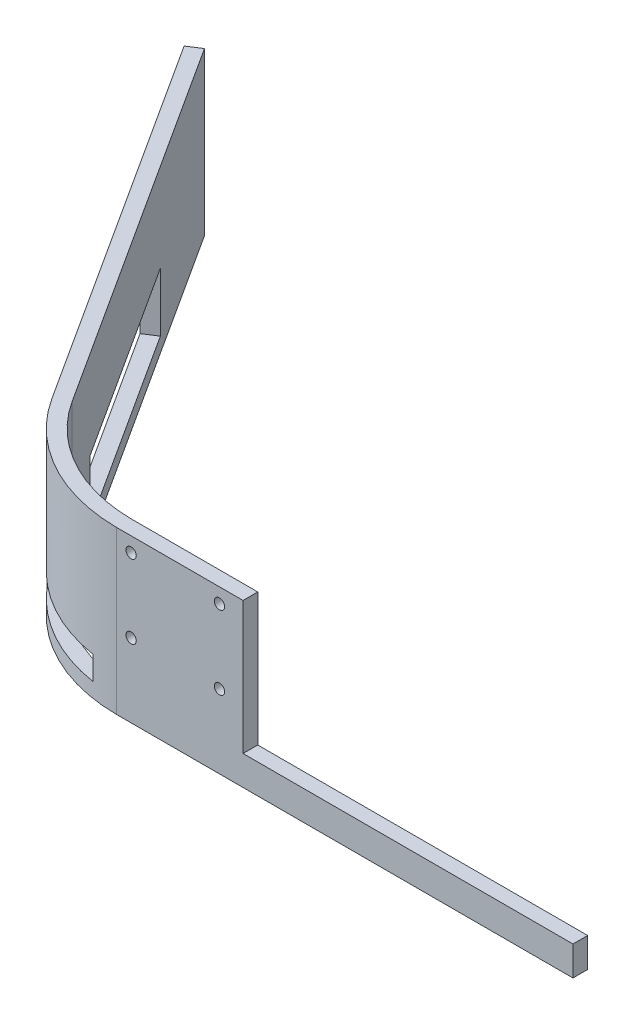
ISO-10303-21;
HEADER;
FILE_DESCRIPTION(('STEP AP214'),'2;1');
FILE_NAME('part.step','',(''),(''),'','','');
FILE_SCHEMA(('AUTOMOTIVE_DESIGN { 1 0 10303 214 1 1 1 1 }'));
ENDSEC;
DATA;
#1=APPLICATION_CONTEXT('core data for automotive mechanical design processes');
#2=APPLICATION_PROTOCOL_DEFINITION('international standard','automotive_design',2000,#1);
#3=PRODUCT_CONTEXT('',#1,'mechanical');
#4=PRODUCT('Part','Part','',(#3));
#5=PRODUCT_RELATED_PRODUCT_CATEGORY('part','',(#4));
#6=PRODUCT_DEFINITION_FORMATION('','',#4);
#7=PRODUCT_DEFINITION_CONTEXT('part definition',#1,'design');
#8=PRODUCT_DEFINITION('design','',#6,#7);
#9=PRODUCT_DEFINITION_SHAPE('','',#8);
#10=(LENGTH_UNIT() NAMED_UNIT(*) SI_UNIT(.MILLI.,.METRE.));
#11=(NAMED_UNIT(*) PLANE_ANGLE_UNIT() SI_UNIT($,.RADIAN.));
#12=(NAMED_UNIT(*) SI_UNIT($,.STERADIAN.) SOLID_ANGLE_UNIT());
#13=UNCERTAINTY_MEASURE_WITH_UNIT(LENGTH_MEASURE(1.E-05),#10,'distance_accuracy_value','');
#14=(GEOMETRIC_REPRESENTATION_CONTEXT(3) GLOBAL_UNCERTAINTY_ASSIGNED_CONTEXT((#13)) GLOBAL_UNIT_ASSIGNED_CONTEXT((#10,
#11,#12)) REPRESENTATION_CONTEXT('',''));
#15=CARTESIAN_POINT('',(0.,0.,0.));
#16=DIRECTION('',(0.,0.,1.));
#17=DIRECTION('',(1.,0.,0.));
#18=AXIS2_PLACEMENT_3D('',#15,#16,#17);
#19=CARTESIAN_POINT('',(0.,55.,0.));
#20=DIRECTION('',(0.,0.,-1.));
#21=DIRECTION('',(-1.,0.,0.));
#22=AXIS2_PLACEMENT_3D('',#19,#20,#21);
#23=PLANE('',#22);
#24=CARTESIAN_POINT('',(35.,25.,0.));
#25=DIRECTION('',(0.,0.,1.));
#26=DIRECTION('',(1.,0.,0.));
#27=AXIS2_PLACEMENT_3D('',#24,#25,#26);
#28=CIRCLE('',#27,1.75);
#29=CARTESIAN_POINT('',(36.75,25.,0.));
#30=VERTEX_POINT('',#29);
#31=EDGE_CURVE('E199',#30,#30,#28,.T.);
#32=ORIENTED_EDGE('',*,*,#31,.F.);
#33=EDGE_LOOP('',(#32));
#34=FACE_BOUND('',#33,.T.);
#35=CARTESIAN_POINT('',(35.,50.,0.));
#36=DIRECTION('',(0.,0.,1.));
#37=DIRECTION('',(1.,0.,0.));
#38=AXIS2_PLACEMENT_3D('',#35,#36,#37);
#39=CIRCLE('',#38,1.75);
#40=CARTESIAN_POINT('',(36.75,50.,0.));
#41=VERTEX_POINT('',#40);
#42=EDGE_CURVE('E224',#41,#41,#39,.T.);
#43=ORIENTED_EDGE('',*,*,#42,.F.);
#44=EDGE_LOOP('',(#43));
#45=FACE_BOUND('',#44,.T.);
#46=CARTESIAN_POINT('',(5.,50.,0.));
#47=DIRECTION('',(0.,0.,1.));
#48=DIRECTION('',(1.,0.,0.));
#49=AXIS2_PLACEMENT_3D('',#46,#47,#48);
#50=CIRCLE('',#49,1.75);
#51=CARTESIAN_POINT('',(6.75,50.,0.));
#52=VERTEX_POINT('',#51);
#53=EDGE_CURVE('E221',#52,#52,#50,.T.);
#54=ORIENTED_EDGE('',*,*,#53,.F.);
#55=EDGE_LOOP('',(#54));
#56=FACE_BOUND('',#55,.T.);
#57=CARTESIAN_POINT('',(5.,25.,0.));
#58=DIRECTION('',(0.,0.,1.));
#59=DIRECTION('',(1.,0.,0.));
#60=AXIS2_PLACEMENT_3D('',#57,#58,#59);
#61=CIRCLE('',#60,1.75);
#62=CARTESIAN_POINT('',(6.75,25.,0.));
#63=VERTEX_POINT('',#62);
#64=EDGE_CURVE('E210',#63,#63,#61,.T.);
#65=ORIENTED_EDGE('',*,*,#64,.F.);
#66=EDGE_LOOP('',(#65));
#67=FACE_BOUND('',#66,.T.);
#68=DIRECTION('',(-1.,0.,0.));
#69=VECTOR('',#68,1.);
#70=CARTESIAN_POINT('',(0.,9.99999999999998,0.));
#71=LINE('',#70,#69);
#72=CARTESIAN_POINT('',(155.,10.,0.));
#73=VERTEX_POINT('',#72);
#74=CARTESIAN_POINT('',(43.,9.99999999999999,0.));
#75=VERTEX_POINT('',#74);
#76=EDGE_CURVE('E209',#73,#75,#71,.T.);
#77=ORIENTED_EDGE('',*,*,#76,.T.);
#78=DIRECTION('',(0.,-1.,0.));
#79=VECTOR('',#78,1.);
#80=CARTESIAN_POINT('',(43.,0.,0.));
#81=LINE('',#80,#79);
#82=CARTESIAN_POINT('',(43.,55.,0.));
#83=VERTEX_POINT('',#82);
#84=EDGE_CURVE('E206',#83,#75,#81,.T.);
#85=ORIENTED_EDGE('',*,*,#84,.F.);
#86=DIRECTION('',(1.,0.,0.));
#87=VECTOR('',#86,1.);
#88=CARTESIAN_POINT('',(0.,55.,0.));
#89=LINE('',#88,#87);
#90=CARTESIAN_POINT('',(0.,55.,0.));
#91=VERTEX_POINT('',#90);
#92=EDGE_CURVE('E240',#91,#83,#89,.T.);
#93=ORIENTED_EDGE('',*,*,#92,.F.);
#94=DIRECTION('',(0.,-1.,0.));
#95=VECTOR('',#94,1.);
#96=CARTESIAN_POINT('',(0.,55.,0.));
#97=LINE('',#96,#95);
#98=CARTESIAN_POINT('',(0.,0.,0.));
#99=VERTEX_POINT('',#98);
#100=EDGE_CURVE('E303',#91,#99,#97,.T.);
#101=ORIENTED_EDGE('',*,*,#100,.T.);
#102=DIRECTION('',(1.,0.,0.));
#103=VECTOR('',#102,1.);
#104=CARTESIAN_POINT('',(0.,0.,0.));
#105=LINE('',#104,#103);
#106=CARTESIAN_POINT('',(155.,0.,0.));
#107=VERTEX_POINT('',#106);
#108=EDGE_CURVE('E270',#99,#107,#105,.T.);
#109=ORIENTED_EDGE('',*,*,#108,.T.);
#110=DIRECTION('',(0.,-1.,0.));
#111=VECTOR('',#110,1.);
#112=CARTESIAN_POINT('',(155.,55.,0.));
#113=LINE('',#112,#111);
#114=EDGE_CURVE('E301',#73,#107,#113,.T.);
#115=ORIENTED_EDGE('',*,*,#114,.F.);
#116=EDGE_LOOP('',(#77,#85,#93,#101,#109,#115));
#117=FACE_BOUND('',#116,.T.);
#118=ADVANCED_FACE('F39',(#34,#45,#56,#67,#117),#23,.F.);
#119=CARTESIAN_POINT('',(155.,55.,0.));
#120=DIRECTION('',(-1.,0.,0.));
#121=DIRECTION('',(0.,0.,1.));
#122=AXIS2_PLACEMENT_3D('',#119,#120,#121);
#123=PLANE('',#122);
#124=DIRECTION('',(0.,0.,1.));
#125=VECTOR('',#124,1.);
#126=CARTESIAN_POINT('',(155.,10.,-55.));
#127=LINE('',#126,#125);
#128=CARTESIAN_POINT('',(155.,10.,-5.));
#129=VERTEX_POINT('',#128);
#130=EDGE_CURVE('E214',#129,#73,#127,.T.);
#131=ORIENTED_EDGE('',*,*,#130,.T.);
#132=ORIENTED_EDGE('',*,*,#114,.T.);
#133=DIRECTION('',(0.,0.,-1.));
#134=VECTOR('',#133,1.);
#135=CARTESIAN_POINT('',(155.,0.,0.));
#136=LINE('',#135,#134);
#137=CARTESIAN_POINT('',(155.,0.,-5.));
#138=VERTEX_POINT('',#137);
#139=EDGE_CURVE('E275',#107,#138,#136,.T.);
#140=ORIENTED_EDGE('',*,*,#139,.T.);
#141=DIRECTION('',(0.,-1.,0.));
#142=VECTOR('',#141,1.);
#143=CARTESIAN_POINT('',(155.,55.,-5.));
#144=LINE('',#143,#142);
#145=EDGE_CURVE('E299',#129,#138,#144,.T.);
#146=ORIENTED_EDGE('',*,*,#145,.F.);
#147=EDGE_LOOP('',(#131,#132,#140,#146));
#148=FACE_BOUND('',#147,.T.);
#149=ADVANCED_FACE('F359',(#148),#123,.F.);
#150=CARTESIAN_POINT('',(0.,55.,-5.));
#151=DIRECTION('',(0.,0.,-1.));
#152=DIRECTION('',(-1.,0.,0.));
#153=AXIS2_PLACEMENT_3D('',#150,#151,#152);
#154=PLANE('',#153);
#155=CARTESIAN_POINT('',(5.,25.,-5.));
#156=DIRECTION('',(0.,0.,-1.));
#157=DIRECTION('',(-1.,0.,0.));
#158=AXIS2_PLACEMENT_3D('',#155,#156,#157);
#159=CIRCLE('',#158,1.75);
#160=CARTESIAN_POINT('',(3.25,25.,-5.));
#161=VERTEX_POINT('',#160);
#162=EDGE_CURVE('E265',#161,#161,#159,.T.);
#163=ORIENTED_EDGE('',*,*,#162,.F.);
#164=EDGE_LOOP('',(#163));
#165=FACE_BOUND('',#164,.T.);
#166=CARTESIAN_POINT('',(5.,50.,-5.));
#167=DIRECTION('',(0.,0.,-1.));
#168=DIRECTION('',(-1.,0.,0.));
#169=AXIS2_PLACEMENT_3D('',#166,#167,#168);
#170=CIRCLE('',#169,1.75);
#171=CARTESIAN_POINT('',(3.25,50.,-5.));
#172=VERTEX_POINT('',#171);
#173=EDGE_CURVE('E662',#172,#172,#170,.T.);
#174=ORIENTED_EDGE('',*,*,#173,.F.);
#175=EDGE_LOOP('',(#174));
#176=FACE_BOUND('',#175,.T.);
#177=CARTESIAN_POINT('',(35.,50.,-5.));
#178=DIRECTION('',(0.,0.,-1.));
#179=DIRECTION('',(-1.,0.,0.));
#180=AXIS2_PLACEMENT_3D('',#177,#178,#179);
#181=CIRCLE('',#180,1.75);
#182=CARTESIAN_POINT('',(33.25,50.,-5.));
#183=VERTEX_POINT('',#182);
#184=EDGE_CURVE('E659',#183,#183,#181,.T.);
#185=ORIENTED_EDGE('',*,*,#184,.F.);
#186=EDGE_LOOP('',(#185));
#187=FACE_BOUND('',#186,.T.);
#188=CARTESIAN_POINT('',(35.,25.,-5.));
#189=DIRECTION('',(0.,0.,-1.));
#190=DIRECTION('',(-1.,0.,0.));
#191=AXIS2_PLACEMENT_3D('',#188,#189,#190);
#192=CIRCLE('',#191,1.75);
#193=CARTESIAN_POINT('',(33.25,25.,-5.));
#194=VERTEX_POINT('',#193);
#195=EDGE_CURVE('E230',#194,#194,#192,.T.);
#196=ORIENTED_EDGE('',*,*,#195,.F.);
#197=EDGE_LOOP('',(#196));
#198=FACE_BOUND('',#197,.T.);
#199=DIRECTION('',(0.,1.,0.));
#200=VECTOR('',#199,1.);
#201=CARTESIAN_POINT('',(43.,55.,-5.));
#202=LINE('',#201,#200);
#203=CARTESIAN_POINT('',(43.,9.99999999999999,-5.));
#204=VERTEX_POINT('',#203);
#205=CARTESIAN_POINT('',(43.,55.,-5.));
#206=VERTEX_POINT('',#205);
#207=EDGE_CURVE('E217',#204,#206,#202,.T.);
#208=ORIENTED_EDGE('',*,*,#207,.F.);
#209=DIRECTION('',(1.,0.,0.));
#210=VECTOR('',#209,1.);
#211=CARTESIAN_POINT('',(0.,9.99999999999998,-5.));
#212=LINE('',#211,#210);
#213=EDGE_CURVE('E383',#204,#129,#212,.T.);
#214=ORIENTED_EDGE('',*,*,#213,.T.);
#215=ORIENTED_EDGE('',*,*,#145,.T.);
#216=DIRECTION('',(1.,0.,0.));
#217=VECTOR('',#216,1.);
#218=CARTESIAN_POINT('',(0.,0.,-5.));
#219=LINE('',#218,#217);
#220=CARTESIAN_POINT('',(0.,0.,-5.));
#221=VERTEX_POINT('',#220);
#222=EDGE_CURVE('E278',#221,#138,#219,.T.);
#223=ORIENTED_EDGE('',*,*,#222,.F.);
#224=DIRECTION('',(0.,-1.,0.));
#225=VECTOR('',#224,1.);
#226=CARTESIAN_POINT('',(0.,55.,-5.));
#227=LINE('',#226,#225);
#228=CARTESIAN_POINT('',(0.,55.,-5.));
#229=VERTEX_POINT('',#228);
#230=EDGE_CURVE('E297',#229,#221,#227,.T.);
#231=ORIENTED_EDGE('',*,*,#230,.F.);
#232=DIRECTION('',(1.,0.,0.));
#233=VECTOR('',#232,1.);
#234=CARTESIAN_POINT('',(0.,55.,-5.));
#235=LINE('',#234,#233);
#236=EDGE_CURVE('E245',#229,#206,#235,.T.);
#237=ORIENTED_EDGE('',*,*,#236,.T.);
#238=EDGE_LOOP('',(#208,#214,#215,#223,#231,#237));
#239=FACE_BOUND('',#238,.T.);
#240=ADVANCED_FACE('F333',(#165,#176,#187,#198,#239),#154,.T.);
#241=CARTESIAN_POINT('',(-22.2397076710408,55.,14.3229453383998));
#242=DIRECTION('',(-0.840731265834287,0.,0.541452619024673));
#243=DIRECTION('',(0.541452619024673,0.,0.840731265834287));
#244=AXIS2_PLACEMENT_3D('',#241,#242,#243);
#245=PLANE('',#244);
#246=DIRECTION('',(0.,1.,0.));
#247=VECTOR('',#246,1.);
#248=CARTESIAN_POINT('',(-59.6111595267926,25.,-43.7049354415426));
#249=LINE('',#248,#247);
#250=CARTESIAN_POINT('',(-59.6111595267926,5.,-43.7049354415426));
#251=VERTEX_POINT('',#250);
#252=CARTESIAN_POINT('',(-59.6111595267926,25.,-43.7049354415426));
#253=VERTEX_POINT('',#252);
#254=EDGE_CURVE('E181',#251,#253,#249,.T.);
#255=ORIENTED_EDGE('',*,*,#254,.F.);
#256=DIRECTION('',(0.541452619024673,0.,0.840731265834287));
#257=VECTOR('',#256,1.);
#258=CARTESIAN_POINT('',(-59.6111595267926,5.,-43.7049354415426));
#259=LINE('',#258,#257);
#260=CARTESIAN_POINT('',(-102.927369048766,4.99999999999999,-110.963436708286));
#261=VERTEX_POINT('',#260);
#262=EDGE_CURVE('E193',#261,#251,#259,.T.);
#263=ORIENTED_EDGE('',*,*,#262,.F.);
#264=DIRECTION('',(0.,-1.,0.));
#265=VECTOR('',#264,1.);
#266=CARTESIAN_POINT('',(-102.927369048766,25.,-110.963436708286));
#267=LINE('',#266,#265);
#268=CARTESIAN_POINT('',(-102.927369048766,25.,-110.963436708286));
#269=VERTEX_POINT('',#268);
#270=EDGE_CURVE('E190',#269,#261,#267,.T.);
#271=ORIENTED_EDGE('',*,*,#270,.F.);
#272=DIRECTION('',(-0.541452619024673,0.,-0.840731265834287));
#273=VECTOR('',#272,1.);
#274=CARTESIAN_POINT('',(-59.6111595267926,25.,-43.7049354415426));
#275=LINE('',#274,#273);
#276=EDGE_CURVE('E183',#253,#269,#275,.T.);
#277=ORIENTED_EDGE('',*,*,#276,.F.);
#278=EDGE_LOOP('',(#255,#263,#271,#277));
#279=FACE_BOUND('',#278,.T.);
#280=DIRECTION('',(-0.541452619024673,0.,-0.840731265834287));
#281=VECTOR('',#280,1.);
#282=CARTESIAN_POINT('',(-22.2397076710408,0.,14.3229453383998));
#283=LINE('',#282,#281);
#284=CARTESIAN_POINT('',(-48.7821071462992,0.,-26.8903101248569));
#285=VERTEX_POINT('',#284);
#286=CARTESIAN_POINT('',(-130.,0.,-153.));
#287=VERTEX_POINT('',#286);
#288=EDGE_CURVE('E261',#285,#287,#283,.T.);
#289=ORIENTED_EDGE('',*,*,#288,.F.);
#290=CARTESIAN_POINT('',(-48.7821071462991,55.,-26.8903101248569));
#291=DIRECTION('',(0.,-1.,0.));
#292=VECTOR('',#291,1.);
#293=LINE('',#290,#292);
#294=CARTESIAN_POINT('',(-48.7821071462992,55.,-26.8903101248569));
#295=VERTEX_POINT('',#294);
#296=EDGE_CURVE('E305',#295,#285,#293,.T.);
#297=ORIENTED_EDGE('',*,*,#296,.F.);
#298=DIRECTION('',(-0.541452619024673,0.,-0.840731265834287));
#299=VECTOR('',#298,1.);
#300=CARTESIAN_POINT('',(-22.2397076710408,55.,14.3229453383998));
#301=LINE('',#300,#299);
#302=CARTESIAN_POINT('',(-130.,55.,-153.));
#303=VERTEX_POINT('',#302);
#304=EDGE_CURVE('E231',#295,#303,#301,.T.);
#305=ORIENTED_EDGE('',*,*,#304,.T.);
#306=DIRECTION('',(0.,-1.,0.));
#307=VECTOR('',#306,1.);
#308=CARTESIAN_POINT('',(-130.,55.,-153.));
#309=LINE('',#308,#307);
#310=EDGE_CURVE('E260',#303,#287,#309,.T.);
#311=ORIENTED_EDGE('',*,*,#310,.T.);
#312=EDGE_LOOP('',(#289,#297,#305,#311));
#313=FACE_BOUND('',#312,.T.);
#314=ADVANCED_FACE('F41',(#279,#313),#245,.T.);
#315=CARTESIAN_POINT('',(0.396550759782094,55.,-58.4127127013932));
#316=DIRECTION('',(0.,-1.,0.));
#317=DIRECTION('',(0.,0.,-1.));
#318=AXIS2_PLACEMENT_3D('',#315,#316,#317);
#319=CYLINDRICAL_SURFACE('',#318,58.4140587328136);
#320=DIRECTION('',(0.,-1.,0.));
#321=VECTOR('',#320,1.);
#322=CARTESIAN_POINT('',(-8.73504579594361,55.,-0.716818549520951));
#323=LINE('',#322,#321);
#324=CARTESIAN_POINT('',(-8.73504579594363,5.,-0.716818549520958));
#325=VERTEX_POINT('',#324);
#326=CARTESIAN_POINT('',(-8.73504579594363,13.,-0.716818549520958));
#327=VERTEX_POINT('',#326);
#328=EDGE_CURVE('E173',#325,#327,#323,.F.);
#329=ORIENTED_EDGE('',*,*,#328,.F.);
#330=CARTESIAN_POINT('',(0.396550759782094,5.,-58.4127127013932));
#331=DIRECTION('',(0.,-1.,0.));
#332=DIRECTION('',(0.,0.,-1.));
#333=AXIS2_PLACEMENT_3D('',#330,#331,#332);
#334=CIRCLE('',#333,58.4140587328136);
#335=CARTESIAN_POINT('',(-43.714548340817,5.,-20.1189378316091));
#336=VERTEX_POINT('',#335);
#337=EDGE_CURVE('E162',#336,#325,#334,.F.);
#338=ORIENTED_EDGE('',*,*,#337,.F.);
#339=DIRECTION('',(0.,-1.,0.));
#340=VECTOR('',#339,1.);
#341=CARTESIAN_POINT('',(-43.714548340817,55.,-20.1189378316091));
#342=LINE('',#341,#340);
#343=CARTESIAN_POINT('',(-43.714548340817,13.,-20.1189378316091));
#344=VERTEX_POINT('',#343);
#345=EDGE_CURVE('E167',#344,#336,#342,.T.);
#346=ORIENTED_EDGE('',*,*,#345,.F.);
#347=CARTESIAN_POINT('',(0.396550759782094,13.,-58.4127127013932));
#348=DIRECTION('',(0.,1.,0.));
#349=DIRECTION('',(0.,0.,1.));
#350=AXIS2_PLACEMENT_3D('',#347,#348,#349);
#351=CIRCLE('',#350,58.4140587328136);
#352=EDGE_CURVE('E180',#327,#344,#351,.F.);
#353=ORIENTED_EDGE('',*,*,#352,.F.);
#354=EDGE_LOOP('',(#329,#338,#346,#353));
#355=FACE_BOUND('',#354,.T.);
#356=CARTESIAN_POINT('',(0.396550759782094,0.,-58.4127127013932));
#357=DIRECTION('',(0.,1.,0.));
#358=DIRECTION('',(0.,0.,1.));
#359=AXIS2_PLACEMENT_3D('',#356,#357,#358);
#360=CIRCLE('',#359,58.4140587328136);
#361=EDGE_CURVE('E264',#99,#285,#360,.F.);
#362=ORIENTED_EDGE('',*,*,#361,.F.);
#363=ORIENTED_EDGE('',*,*,#100,.F.);
#364=CARTESIAN_POINT('',(0.396550759782094,55.,-58.4127127013932));
#365=DIRECTION('',(0.,1.,0.));
#366=DIRECTION('',(0.,0.,1.));
#367=AXIS2_PLACEMENT_3D('',#364,#365,#366);
#368=CIRCLE('',#367,58.4140587328136);
#369=EDGE_CURVE('E234',#91,#295,#368,.F.);
#370=ORIENTED_EDGE('',*,*,#369,.T.);
#371=ORIENTED_EDGE('',*,*,#296,.T.);
#372=EDGE_LOOP('',(#362,#363,#370,#371));
#373=FACE_BOUND('',#372,.T.);
#374=ADVANCED_FACE('F178',(#355,#373),#319,.T.);
#375=CARTESIAN_POINT('',(0.396550759782094,55.,-58.4127127013932));
#376=DIRECTION('',(0.,-1.,0.));
#377=DIRECTION('',(0.,0.,-1.));
#378=AXIS2_PLACEMENT_3D('',#375,#376,#377);
#379=CYLINDRICAL_SURFACE('',#378,53.4141847323972);
#380=CARTESIAN_POINT('',(0.396550759782094,5.,-58.4127127013932));
#381=DIRECTION('',(0.,-1.,0.));
#382=DIRECTION('',(0.,0.,-1.));
#383=AXIS2_PLACEMENT_3D('',#380,#381,#382);
#384=CIRCLE('',#383,53.4141847323972);
#385=CARTESIAN_POINT('',(-41.1251384924856,5.,-24.8117536039988));
#386=VERTEX_POINT('',#385);
#387=CARTESIAN_POINT('',(-6.15025832676357,5.,-5.40125713364843));
#388=VERTEX_POINT('',#387);
#389=EDGE_CURVE('E400',#386,#388,#384,.F.);
#390=ORIENTED_EDGE('',*,*,#389,.T.);
#391=DIRECTION('',(0.,-1.,0.));
#392=VECTOR('',#391,1.);
#393=CARTESIAN_POINT('',(-6.15025832676355,55.,-5.40125713364842));
#394=LINE('',#393,#392);
#395=CARTESIAN_POINT('',(-6.15025832676357,13.,-5.40125713364843));
#396=VERTEX_POINT('',#395);
#397=EDGE_CURVE('E11',#388,#396,#394,.F.);
#398=ORIENTED_EDGE('',*,*,#397,.T.);
#399=CARTESIAN_POINT('',(0.396550759782094,13.,-58.4127127013932));
#400=DIRECTION('',(0.,1.,0.));
#401=DIRECTION('',(0.,0.,1.));
#402=AXIS2_PLACEMENT_3D('',#399,#400,#401);
#403=CIRCLE('',#402,53.4141847323972);
#404=CARTESIAN_POINT('',(-41.1251384924856,13.,-24.8117536039988));
#405=VERTEX_POINT('',#404);
#406=EDGE_CURVE('E48',#396,#405,#403,.F.);
#407=ORIENTED_EDGE('',*,*,#406,.T.);
#408=DIRECTION('',(0.,-1.,0.));
#409=VECTOR('',#408,1.);
#410=CARTESIAN_POINT('',(-41.1251384924856,55.,-24.8117536039988));
#411=LINE('',#410,#409);
#412=EDGE_CURVE('E402',#405,#386,#411,.T.);
#413=ORIENTED_EDGE('',*,*,#412,.T.);
#414=EDGE_LOOP('',(#390,#398,#407,#413));
#415=FACE_BOUND('',#414,.T.);
#416=CARTESIAN_POINT('',(0.396550759782094,0.,-58.4127127013932));
#417=DIRECTION('',(0.,1.,0.));
#418=DIRECTION('',(0.,0.,1.));
#419=AXIS2_PLACEMENT_3D('',#416,#417,#418);
#420=CIRCLE('',#419,53.4141847323972);
#421=CARTESIAN_POINT('',(-44.5784984681423,0.,-29.5975426109476));
#422=VERTEX_POINT('',#421);
#423=EDGE_CURVE('E281',#221,#422,#420,.F.);
#424=ORIENTED_EDGE('',*,*,#423,.T.);
#425=CARTESIAN_POINT('',(-44.5784508532954,55.,-29.5975732761371));
#426=DIRECTION('',(0.,-1.,0.));
#427=VECTOR('',#426,1.);
#428=LINE('',#425,#427);
#429=CARTESIAN_POINT('',(-44.5784984681423,55.,-29.5975426109476));
#430=VERTEX_POINT('',#429);
#431=EDGE_CURVE('E296',#430,#422,#428,.T.);
#432=ORIENTED_EDGE('',*,*,#431,.F.);
#433=CARTESIAN_POINT('',(0.396550759782094,55.,-58.4127127013932));
#434=DIRECTION('',(0.,1.,0.));
#435=DIRECTION('',(0.,0.,1.));
#436=AXIS2_PLACEMENT_3D('',#433,#434,#435);
#437=CIRCLE('',#436,53.4141847323972);
#438=EDGE_CURVE('E248',#229,#430,#437,.F.);
#439=ORIENTED_EDGE('',*,*,#438,.F.);
#440=ORIENTED_EDGE('',*,*,#230,.T.);
#441=EDGE_LOOP('',(#424,#432,#439,#440));
#442=FACE_BOUND('',#441,.T.);
#443=ADVANCED_FACE('F326',(#415,#442),#379,.F.);
#444=CARTESIAN_POINT('',(-18.0360513418706,55.,11.6156822432771));
#445=DIRECTION('',(0.840731265834291,0.,-0.541452619024667));
#446=DIRECTION('',(-0.541452619024667,0.,-0.840731265834291));
#447=AXIS2_PLACEMENT_3D('',#444,#445,#446);
#448=PLANE('',#447);
#449=DIRECTION('',(0.,-1.,0.));
#450=VECTOR('',#449,1.);
#451=CARTESIAN_POINT('',(-55.4075031976219,55.,-46.4121985366655));
#452=LINE('',#451,#450);
#453=CARTESIAN_POINT('',(-55.4075031976219,25.,-46.4121985366655));
#454=VERTEX_POINT('',#453);
#455=CARTESIAN_POINT('',(-55.4075031976219,5.,-46.4121985366655));
#456=VERTEX_POINT('',#455);
#457=EDGE_CURVE('E398',#454,#456,#452,.T.);
#458=ORIENTED_EDGE('',*,*,#457,.F.);
#459=DIRECTION('',(0.541452619024667,0.,0.840731265834291));
#460=VECTOR('',#459,1.);
#461=CARTESIAN_POINT('',(-18.0360513418706,25.,11.6156822432771));
#462=LINE('',#461,#460);
#463=CARTESIAN_POINT('',(-98.7237127195953,25.,-113.670699803409));
#464=VERTEX_POINT('',#463);
#465=EDGE_CURVE('E385',#464,#454,#462,.T.);
#466=ORIENTED_EDGE('',*,*,#465,.F.);
#467=DIRECTION('',(0.,1.,0.));
#468=VECTOR('',#467,1.);
#469=CARTESIAN_POINT('',(-98.7237127195953,55.,-113.670699803409));
#470=LINE('',#469,#468);
#471=CARTESIAN_POINT('',(-98.7237127195952,4.99999999999999,-113.670699803409));
#472=VERTEX_POINT('',#471);
#473=EDGE_CURVE('E388',#472,#464,#470,.T.);
#474=ORIENTED_EDGE('',*,*,#473,.F.);
#475=DIRECTION('',(-0.541452619024667,0.,-0.840731265834291));
#476=VECTOR('',#475,1.);
#477=CARTESIAN_POINT('',(-18.0360513418706,5.00000000000001,11.6156822432771));
#478=LINE('',#477,#476);
#479=EDGE_CURVE('E396',#456,#472,#478,.T.);
#480=ORIENTED_EDGE('',*,*,#479,.F.);
#481=EDGE_LOOP('',(#458,#466,#474,#480));
#482=FACE_BOUND('',#481,.T.);
#483=DIRECTION('',(0.541452619024667,0.,0.840731265834291));
#484=VECTOR('',#483,1.);
#485=CARTESIAN_POINT('',(-18.0360513418706,0.,11.6156822432771));
#486=LINE('',#485,#484);
#487=CARTESIAN_POINT('',(-125.796343670829,0.,-155.707263095123));
#488=VERTEX_POINT('',#487);
#489=EDGE_CURVE('E284',#488,#422,#486,.T.);
#490=ORIENTED_EDGE('',*,*,#489,.F.);
#491=DIRECTION('',(0.,-1.,0.));
#492=VECTOR('',#491,1.);
#493=CARTESIAN_POINT('',(-125.796343670829,55.,-155.707263095123));
#494=LINE('',#493,#492);
#495=CARTESIAN_POINT('',(-125.796343670829,55.,-155.707263095123));
#496=VERTEX_POINT('',#495);
#497=EDGE_CURVE('E294',#496,#488,#494,.T.);
#498=ORIENTED_EDGE('',*,*,#497,.F.);
#499=DIRECTION('',(0.541452619024667,0.,0.840731265834291));
#500=VECTOR('',#499,1.);
#501=CARTESIAN_POINT('',(-18.0360513418706,55.,11.6156822432771));
#502=LINE('',#501,#500);
#503=EDGE_CURVE('E250',#496,#430,#502,.T.);
#504=ORIENTED_EDGE('',*,*,#503,.T.);
#505=ORIENTED_EDGE('',*,*,#431,.T.);
#506=EDGE_LOOP('',(#490,#498,#504,#505));
#507=FACE_BOUND('',#506,.T.);
#508=ADVANCED_FACE('F315',(#482,#507),#448,.T.);
#509=CARTESIAN_POINT('',(-107.760292328958,55.,-167.3229453384));
#510=DIRECTION('',(-0.541452619024669,0.,-0.840731265834289));
#511=DIRECTION('',(-0.840731265834289,0.,0.541452619024669));
#512=AXIS2_PLACEMENT_3D('',#509,#510,#511);
#513=PLANE('',#512);
#514=DIRECTION('',(0.840731265834289,0.,-0.541452619024669));
#515=VECTOR('',#514,1.);
#516=CARTESIAN_POINT('',(-107.760292328958,0.,-167.3229453384));
#517=LINE('',#516,#515);
#518=EDGE_CURVE('E235',#287,#488,#517,.T.);
#519=ORIENTED_EDGE('',*,*,#518,.F.);
#520=ORIENTED_EDGE('',*,*,#310,.F.);
#521=DIRECTION('',(0.840731265834289,0.,-0.541452619024669));
#522=VECTOR('',#521,1.);
#523=CARTESIAN_POINT('',(-107.760292328958,55.,-167.3229453384));
#524=LINE('',#523,#522);
#525=EDGE_CURVE('E255',#303,#496,#524,.T.);
#526=ORIENTED_EDGE('',*,*,#525,.T.);
#527=ORIENTED_EDGE('',*,*,#497,.T.);
#528=EDGE_LOOP('',(#519,#520,#526,#527));
#529=FACE_BOUND('',#528,.T.);
#530=ADVANCED_FACE('F325',(#529),#513,.T.);
#531=CARTESIAN_POINT('',(0.,55.,0.));
#532=DIRECTION('',(0.,1.,0.));
#533=DIRECTION('',(0.,0.,1.));
#534=AXIS2_PLACEMENT_3D('',#531,#532,#533);
#535=PLANE('',#534);
#536=DIRECTION('',(0.,0.,1.));
#537=VECTOR('',#536,1.);
#538=CARTESIAN_POINT('',(43.,55.,0.));
#539=LINE('',#538,#537);
#540=EDGE_CURVE('E386',#206,#83,#539,.T.);
#541=ORIENTED_EDGE('',*,*,#540,.F.);
#542=ORIENTED_EDGE('',*,*,#236,.F.);
#543=ORIENTED_EDGE('',*,*,#438,.T.);
#544=ORIENTED_EDGE('',*,*,#503,.F.);
#545=ORIENTED_EDGE('',*,*,#525,.F.);
#546=ORIENTED_EDGE('',*,*,#304,.F.);
#547=ORIENTED_EDGE('',*,*,#369,.F.);
#548=ORIENTED_EDGE('',*,*,#92,.T.);
#549=EDGE_LOOP('',(#541,#542,#543,#544,#545,#546,#547,#548));
#550=FACE_BOUND('',#549,.T.);
#551=ADVANCED_FACE('F466',(#550),#535,.T.);
#552=CARTESIAN_POINT('',(0.,0.,0.));
#553=DIRECTION('',(0.,1.,0.));
#554=DIRECTION('',(0.,0.,1.));
#555=AXIS2_PLACEMENT_3D('',#552,#553,#554);
#556=PLANE('',#555);
#557=ORIENTED_EDGE('',*,*,#288,.T.);
#558=ORIENTED_EDGE('',*,*,#518,.T.);
#559=ORIENTED_EDGE('',*,*,#489,.T.);
#560=ORIENTED_EDGE('',*,*,#423,.F.);
#561=ORIENTED_EDGE('',*,*,#222,.T.);
#562=ORIENTED_EDGE('',*,*,#139,.F.);
#563=ORIENTED_EDGE('',*,*,#108,.F.);
#564=ORIENTED_EDGE('',*,*,#361,.T.);
#565=EDGE_LOOP('',(#557,#558,#559,#560,#561,#562,#563,#564));
#566=FACE_BOUND('',#565,.T.);
#567=ADVANCED_FACE('F377',(#566),#556,.F.);
#568=CARTESIAN_POINT('',(0.,9.99999999999998,-55.));
#569=DIRECTION('',(0.,1.,0.));
#570=DIRECTION('',(-1.,0.,0.));
#571=AXIS2_PLACEMENT_3D('',#568,#569,#570);
#572=PLANE('',#571);
#573=DIRECTION('',(0.,0.,1.));
#574=VECTOR('',#573,1.);
#575=CARTESIAN_POINT('',(43.,9.99999999999999,-55.));
#576=LINE('',#575,#574);
#577=EDGE_CURVE('E213',#204,#75,#576,.T.);
#578=ORIENTED_EDGE('',*,*,#577,.T.);
#579=ORIENTED_EDGE('',*,*,#76,.F.);
#580=ORIENTED_EDGE('',*,*,#130,.F.);
#581=ORIENTED_EDGE('',*,*,#213,.F.);
#582=EDGE_LOOP('',(#578,#579,#580,#581));
#583=FACE_BOUND('',#582,.T.);
#584=ADVANCED_FACE('F444',(#583),#572,.T.);
#585=CARTESIAN_POINT('',(43.,0.,-55.));
#586=DIRECTION('',(-1.,0.,0.));
#587=DIRECTION('',(0.,0.,1.));
#588=AXIS2_PLACEMENT_3D('',#585,#586,#587);
#589=PLANE('',#588);
#590=ORIENTED_EDGE('',*,*,#207,.T.);
#591=ORIENTED_EDGE('',*,*,#540,.T.);
#592=ORIENTED_EDGE('',*,*,#84,.T.);
#593=ORIENTED_EDGE('',*,*,#577,.F.);
#594=EDGE_LOOP('',(#590,#591,#592,#593));
#595=FACE_BOUND('',#594,.T.);
#596=ADVANCED_FACE('F447',(#595),#589,.F.);
#597=CARTESIAN_POINT('',(35.,25.,-55.));
#598=DIRECTION('',(0.,0.,1.));
#599=DIRECTION('',(1.,0.,0.));
#600=AXIS2_PLACEMENT_3D('',#597,#598,#599);
#601=CYLINDRICAL_SURFACE('',#600,1.75);
#602=ORIENTED_EDGE('',*,*,#195,.T.);
#603=EDGE_LOOP('',(#602));
#604=FACE_BOUND('',#603,.T.);
#605=ORIENTED_EDGE('',*,*,#31,.T.);
#606=EDGE_LOOP('',(#605));
#607=FACE_BOUND('',#606,.T.);
#608=ADVANCED_FACE('F450',(#604,#607),#601,.F.);
#609=CARTESIAN_POINT('',(35.,50.,-55.));
#610=DIRECTION('',(0.,0.,1.));
#611=DIRECTION('',(1.,0.,0.));
#612=AXIS2_PLACEMENT_3D('',#609,#610,#611);
#613=CYLINDRICAL_SURFACE('',#612,1.75);
#614=ORIENTED_EDGE('',*,*,#184,.T.);
#615=EDGE_LOOP('',(#614));
#616=FACE_BOUND('',#615,.T.);
#617=ORIENTED_EDGE('',*,*,#42,.T.);
#618=EDGE_LOOP('',(#617));
#619=FACE_BOUND('',#618,.T.);
#620=ADVANCED_FACE('F458',(#616,#619),#613,.F.);
#621=CARTESIAN_POINT('',(5.,50.,-55.));
#622=DIRECTION('',(0.,0.,1.));
#623=DIRECTION('',(1.,0.,0.));
#624=AXIS2_PLACEMENT_3D('',#621,#622,#623);
#625=CYLINDRICAL_SURFACE('',#624,1.75);
#626=ORIENTED_EDGE('',*,*,#173,.T.);
#627=EDGE_LOOP('',(#626));
#628=FACE_BOUND('',#627,.T.);
#629=ORIENTED_EDGE('',*,*,#53,.T.);
#630=EDGE_LOOP('',(#629));
#631=FACE_BOUND('',#630,.T.);
#632=ADVANCED_FACE('F454',(#628,#631),#625,.F.);
#633=CARTESIAN_POINT('',(5.,25.,-55.));
#634=DIRECTION('',(0.,0.,1.));
#635=DIRECTION('',(1.,0.,0.));
#636=AXIS2_PLACEMENT_3D('',#633,#634,#635);
#637=CYLINDRICAL_SURFACE('',#636,1.75);
#638=ORIENTED_EDGE('',*,*,#162,.T.);
#639=EDGE_LOOP('',(#638));
#640=FACE_BOUND('',#639,.T.);
#641=ORIENTED_EDGE('',*,*,#64,.T.);
#642=EDGE_LOOP('',(#641));
#643=FACE_BOUND('',#642,.T.);
#644=ADVANCED_FACE('F442',(#640,#643),#637,.F.);
#645=CARTESIAN_POINT('',(-13.3709399059069,25.,-73.4848294878996));
#646=DIRECTION('',(0.541452619024673,0.,0.840731265834287));
#647=DIRECTION('',(0.840731265834287,0.,-0.541452619024673));
#648=AXIS2_PLACEMENT_3D('',#645,#646,#647);
#649=PLANE('',#648);
#650=ORIENTED_EDGE('',*,*,#457,.T.);
#651=DIRECTION('',(-0.840731265834287,0.,0.541452619024673));
#652=VECTOR('',#651,1.);
#653=CARTESIAN_POINT('',(-13.3709399059069,5.,-73.4848294878996));
#654=LINE('',#653,#652);
#655=EDGE_CURVE('E197',#456,#251,#654,.T.);
#656=ORIENTED_EDGE('',*,*,#655,.T.);
#657=ORIENTED_EDGE('',*,*,#254,.T.);
#658=DIRECTION('',(-0.840731265834287,0.,0.541452619024673));
#659=VECTOR('',#658,1.);
#660=CARTESIAN_POINT('',(-13.3709399059069,25.,-73.4848294878996));
#661=LINE('',#660,#659);
#662=EDGE_CURVE('E196',#454,#253,#661,.T.);
#663=ORIENTED_EDGE('',*,*,#662,.F.);
#664=EDGE_LOOP('',(#650,#656,#657,#663));
#665=FACE_BOUND('',#664,.T.);
#666=ADVANCED_FACE('F432',(#665),#649,.F.);
#667=CARTESIAN_POINT('',(-13.3709399059069,5.,-73.4848294878996));
#668=DIRECTION('',(0.,-1.,0.));
#669=DIRECTION('',(0.,0.,-1.));
#670=AXIS2_PLACEMENT_3D('',#667,#668,#669);
#671=PLANE('',#670);
#672=ORIENTED_EDGE('',*,*,#479,.T.);
#673=DIRECTION('',(-0.840731265834287,0.,0.541452619024673));
#674=VECTOR('',#673,1.);
#675=CARTESIAN_POINT('',(-56.6871494278807,4.99999999999999,-140.743330754643));
#676=LINE('',#675,#674);
#677=EDGE_CURVE('E200',#472,#261,#676,.T.);
#678=ORIENTED_EDGE('',*,*,#677,.T.);
#679=ORIENTED_EDGE('',*,*,#262,.T.);
#680=ORIENTED_EDGE('',*,*,#655,.F.);
#681=EDGE_LOOP('',(#672,#678,#679,#680));
#682=FACE_BOUND('',#681,.T.);
#683=ADVANCED_FACE('F428',(#682),#671,.F.);
#684=CARTESIAN_POINT('',(-56.6871494278807,25.,-140.743330754643));
#685=DIRECTION('',(-0.541452619024673,0.,-0.840731265834287));
#686=DIRECTION('',(-0.840731265834287,0.,0.541452619024673));
#687=AXIS2_PLACEMENT_3D('',#684,#685,#686);
#688=PLANE('',#687);
#689=ORIENTED_EDGE('',*,*,#473,.T.);
#690=DIRECTION('',(-0.840731265834287,0.,0.541452619024673));
#691=VECTOR('',#690,1.);
#692=CARTESIAN_POINT('',(-56.6871494278807,25.,-140.743330754643));
#693=LINE('',#692,#691);
#694=EDGE_CURVE('E202',#464,#269,#693,.T.);
#695=ORIENTED_EDGE('',*,*,#694,.T.);
#696=ORIENTED_EDGE('',*,*,#270,.T.);
#697=ORIENTED_EDGE('',*,*,#677,.F.);
#698=EDGE_LOOP('',(#689,#695,#696,#697));
#699=FACE_BOUND('',#698,.T.);
#700=ADVANCED_FACE('F431',(#699),#688,.F.);
#701=CARTESIAN_POINT('',(-13.3709399059069,25.,-73.4848294878996));
#702=DIRECTION('',(0.,1.,0.));
#703=DIRECTION('',(0.,0.,1.));
#704=AXIS2_PLACEMENT_3D('',#701,#702,#703);
#705=PLANE('',#704);
#706=ORIENTED_EDGE('',*,*,#465,.T.);
#707=ORIENTED_EDGE('',*,*,#662,.T.);
#708=ORIENTED_EDGE('',*,*,#276,.T.);
#709=ORIENTED_EDGE('',*,*,#694,.F.);
#710=EDGE_LOOP('',(#706,#707,#708,#709));
#711=FACE_BOUND('',#710,.T.);
#712=ADVANCED_FACE('F427',(#711),#705,.F.);
#713=CARTESIAN_POINT('',(-31.4558902305999,13.,40.4604161758642));
#714=DIRECTION('',(0.875556367180826,0.,0.483115977679393));
#715=DIRECTION('',(0.483115977679393,0.,-0.875556367180826));
#716=AXIS2_PLACEMENT_3D('',#713,#714,#715);
#717=PLANE('',#716);
#718=ORIENTED_EDGE('',*,*,#328,.T.);
#719=DIRECTION('',(0.483115977679393,0.,-0.875556367180826));
#720=VECTOR('',#719,1.);
#721=CARTESIAN_POINT('',(-31.4558902305999,13.,40.4604161758642));
#722=LINE('',#721,#720);
#723=EDGE_CURVE('E168',#327,#396,#722,.T.);
#724=ORIENTED_EDGE('',*,*,#723,.T.);
#725=ORIENTED_EDGE('',*,*,#397,.F.);
#726=DIRECTION('',(0.483115977679393,0.,-0.875556367180826));
#727=VECTOR('',#726,1.);
#728=CARTESIAN_POINT('',(-31.4558902305999,5.,40.4604161758642));
#729=LINE('',#728,#727);
#730=EDGE_CURVE('E60',#325,#388,#729,.T.);
#731=ORIENTED_EDGE('',*,*,#730,.F.);
#732=EDGE_LOOP('',(#718,#724,#725,#731));
#733=FACE_BOUND('',#732,.T.);
#734=ADVANCED_FACE('F171',(#733),#717,.F.);
#735=CARTESIAN_POINT('',(-31.4558902305999,13.,40.4604161758642));
#736=DIRECTION('',(0.,1.,0.));
#737=DIRECTION('',(0.,0.,1.));
#738=AXIS2_PLACEMENT_3D('',#735,#736,#737);
#739=PLANE('',#738);
#740=ORIENTED_EDGE('',*,*,#352,.T.);
#741=DIRECTION('',(0.483115977679393,0.,-0.875556367180826));
#742=VECTOR('',#741,1.);
#743=CARTESIAN_POINT('',(-66.4781449178329,13.,21.1357770686885));
#744=LINE('',#743,#742);
#745=EDGE_CURVE('E410',#344,#405,#744,.T.);
#746=ORIENTED_EDGE('',*,*,#745,.T.);
#747=ORIENTED_EDGE('',*,*,#406,.F.);
#748=ORIENTED_EDGE('',*,*,#723,.F.);
#749=EDGE_LOOP('',(#740,#746,#747,#748));
#750=FACE_BOUND('',#749,.T.);
#751=ADVANCED_FACE('F408',(#750),#739,.F.);
#752=CARTESIAN_POINT('',(-66.4781449178329,13.,21.1357770686885));
#753=DIRECTION('',(-0.875556367180826,0.,-0.483115977679393));
#754=DIRECTION('',(-0.483115977679393,0.,0.875556367180826));
#755=AXIS2_PLACEMENT_3D('',#752,#753,#754);
#756=PLANE('',#755);
#757=ORIENTED_EDGE('',*,*,#345,.T.);
#758=DIRECTION('',(0.483115977679393,0.,-0.875556367180826));
#759=VECTOR('',#758,1.);
#760=CARTESIAN_POINT('',(-66.4781449178329,5.,21.1357770686885));
#761=LINE('',#760,#759);
#762=EDGE_CURVE('E55',#336,#386,#761,.T.);
#763=ORIENTED_EDGE('',*,*,#762,.T.);
#764=ORIENTED_EDGE('',*,*,#412,.F.);
#765=ORIENTED_EDGE('',*,*,#745,.F.);
#766=EDGE_LOOP('',(#757,#763,#764,#765));
#767=FACE_BOUND('',#766,.T.);
#768=ADVANCED_FACE('F415',(#767),#756,.F.);
#769=CARTESIAN_POINT('',(-31.4558902305999,5.,40.4604161758642));
#770=DIRECTION('',(0.,-1.,0.));
#771=DIRECTION('',(0.,0.,-1.));
#772=AXIS2_PLACEMENT_3D('',#769,#770,#771);
#773=PLANE('',#772);
#774=ORIENTED_EDGE('',*,*,#337,.T.);
#775=ORIENTED_EDGE('',*,*,#730,.T.);
#776=ORIENTED_EDGE('',*,*,#389,.F.);
#777=ORIENTED_EDGE('',*,*,#762,.F.);
#778=EDGE_LOOP('',(#774,#775,#776,#777));
#779=FACE_BOUND('',#778,.T.);
#780=ADVANCED_FACE('F163',(#779),#773,.F.);
#781=CLOSED_SHELL('',(#118,#149,#240,#314,#374,#443,#508,#530,#551,#567,#584,#596,#608,#620,
#632,#644,#666,#683,#700,#712,#734,#751,#768,#780));
#782=MANIFOLD_SOLID_BREP('B2',#781);
#783=ADVANCED_BREP_SHAPE_REPRESENTATION('',(#18,#782),#14);
#784=SHAPE_DEFINITION_REPRESENTATION(#9,#783);
ENDSEC;
END-ISO-10303-21;
